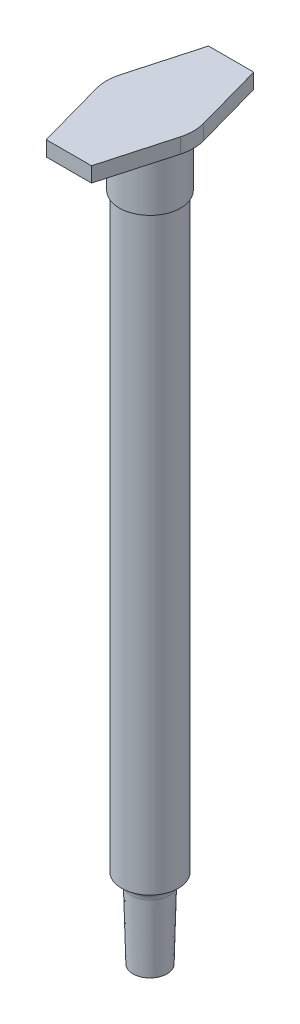
ISO-10303-21;
HEADER;
FILE_DESCRIPTION(('STEP AP214'),'2;1');
FILE_NAME('part.step','',(''),(''),'','','');
FILE_SCHEMA(('AUTOMOTIVE_DESIGN { 1 0 10303 214 1 1 1 1 }'));
ENDSEC;
DATA;
#1=APPLICATION_CONTEXT('core data for automotive mechanical design processes');
#2=APPLICATION_PROTOCOL_DEFINITION('international standard','automotive_design',2000,#1);
#3=PRODUCT_CONTEXT('',#1,'mechanical');
#4=PRODUCT('Part','Part','',(#3));
#5=PRODUCT_RELATED_PRODUCT_CATEGORY('part','',(#4));
#6=PRODUCT_DEFINITION_FORMATION('','',#4);
#7=PRODUCT_DEFINITION_CONTEXT('part definition',#1,'design');
#8=PRODUCT_DEFINITION('design','',#6,#7);
#9=PRODUCT_DEFINITION_SHAPE('','',#8);
#10=(LENGTH_UNIT() NAMED_UNIT(*) SI_UNIT(.MILLI.,.METRE.));
#11=(NAMED_UNIT(*) PLANE_ANGLE_UNIT() SI_UNIT($,.RADIAN.));
#12=(NAMED_UNIT(*) SI_UNIT($,.STERADIAN.) SOLID_ANGLE_UNIT());
#13=UNCERTAINTY_MEASURE_WITH_UNIT(LENGTH_MEASURE(1.E-05),#10,'distance_accuracy_value','');
#14=(GEOMETRIC_REPRESENTATION_CONTEXT(3) GLOBAL_UNCERTAINTY_ASSIGNED_CONTEXT((#13)) GLOBAL_UNIT_ASSIGNED_CONTEXT((#10,
#11,#12)) REPRESENTATION_CONTEXT('',''));
#15=CARTESIAN_POINT('',(0.,0.,0.));
#16=DIRECTION('',(0.,0.,1.));
#17=DIRECTION('',(1.,0.,0.));
#18=AXIS2_PLACEMENT_3D('',#15,#16,#17);
#19=CARTESIAN_POINT('',(0.,69.2,0.));
#20=DIRECTION('',(0.,-1.,0.));
#21=DIRECTION('',(0.,0.,-1.));
#22=AXIS2_PLACEMENT_3D('',#19,#20,#21);
#23=CYLINDRICAL_SURFACE('',#22,3.325);
#24=CARTESIAN_POINT('',(0.,69.2,0.));
#25=DIRECTION('',(0.,1.,0.));
#26=DIRECTION('',(0.,0.,1.));
#27=AXIS2_PLACEMENT_3D('',#24,#25,#26);
#28=CIRCLE('',#27,3.325);
#29=CARTESIAN_POINT('',(0.,69.2,3.325));
#30=VERTEX_POINT('',#29);
#31=EDGE_CURVE('E11',#30,#30,#28,.T.);
#32=ORIENTED_EDGE('',*,*,#31,.F.);
#33=EDGE_LOOP('',(#32));
#34=FACE_BOUND('',#33,.T.);
#35=CARTESIAN_POINT('',(0.,0.,0.));
#36=DIRECTION('',(0.,1.,0.));
#37=DIRECTION('',(0.,0.,1.));
#38=AXIS2_PLACEMENT_3D('',#35,#36,#37);
#39=CIRCLE('',#38,3.325);
#40=CARTESIAN_POINT('',(0.,0.,3.325));
#41=VERTEX_POINT('',#40);
#42=EDGE_CURVE('E164',#41,#41,#39,.T.);
#43=ORIENTED_EDGE('',*,*,#42,.T.);
#44=EDGE_LOOP('',(#43));
#45=FACE_BOUND('',#44,.T.);
#46=ADVANCED_FACE('F40',(#34,#45),#23,.T.);
#47=CARTESIAN_POINT('',(0.,69.2,0.));
#48=DIRECTION('',(0.,1.,0.));
#49=DIRECTION('',(0.,0.,1.));
#50=AXIS2_PLACEMENT_3D('',#47,#48,#49);
#51=PLANE('',#50);
#52=CARTESIAN_POINT('',(0.,69.2,0.));
#53=DIRECTION('',(0.,1.,0.));
#54=DIRECTION('',(0.,0.,1.));
#55=AXIS2_PLACEMENT_3D('',#52,#53,#54);
#56=CIRCLE('',#55,3.59);
#57=CARTESIAN_POINT('',(0.,69.2,3.59));
#58=VERTEX_POINT('',#57);
#59=EDGE_CURVE('E203',#58,#58,#56,.T.);
#60=ORIENTED_EDGE('',*,*,#59,.F.);
#61=EDGE_LOOP('',(#60));
#62=FACE_BOUND('',#61,.T.);
#63=ORIENTED_EDGE('',*,*,#31,.T.);
#64=EDGE_LOOP('',(#63));
#65=FACE_BOUND('',#64,.T.);
#66=ADVANCED_FACE('F213',(#62,#65),#51,.F.);
#67=CARTESIAN_POINT('',(0.,76.02,0.));
#68=DIRECTION('',(0.,-1.,0.));
#69=DIRECTION('',(0.,0.,-1.));
#70=AXIS2_PLACEMENT_3D('',#67,#68,#69);
#71=CYLINDRICAL_SURFACE('',#70,3.59);
#72=CARTESIAN_POINT('',(0.,76.02,0.));
#73=DIRECTION('',(0.,1.,0.));
#74=DIRECTION('',(0.,0.,1.));
#75=AXIS2_PLACEMENT_3D('',#72,#73,#74);
#76=CIRCLE('',#75,3.59);
#77=CARTESIAN_POINT('',(0.,76.02,3.59));
#78=VERTEX_POINT('',#77);
#79=EDGE_CURVE('E49',#78,#78,#76,.T.);
#80=ORIENTED_EDGE('',*,*,#79,.F.);
#81=EDGE_LOOP('',(#80));
#82=FACE_BOUND('',#81,.T.);
#83=ORIENTED_EDGE('',*,*,#59,.T.);
#84=EDGE_LOOP('',(#83));
#85=FACE_BOUND('',#84,.T.);
#86=ADVANCED_FACE('F211',(#82,#85),#71,.T.);
#87=CARTESIAN_POINT('',(0.,76.02,0.));
#88=DIRECTION('',(0.,1.,0.));
#89=DIRECTION('',(0.,0.,1.));
#90=AXIS2_PLACEMENT_3D('',#87,#88,#89);
#91=PLANE('',#90);
#92=CARTESIAN_POINT('',(0.,76.02,0.));
#93=DIRECTION('',(0.,1.,0.));
#94=DIRECTION('',(0.,0.,1.));
#95=AXIS2_PLACEMENT_3D('',#92,#93,#94);
#96=CIRCLE('',#95,5.10500000000001);
#97=CARTESIAN_POINT('',(-4.91772543004469,76.02,-1.37003707785296));
#98=VERTEX_POINT('',#97);
#99=CARTESIAN_POINT('',(-4.91772543004469,76.02,1.37003707785296));
#100=VERTEX_POINT('',#99);
#101=EDGE_CURVE('E159',#98,#100,#96,.T.);
#102=ORIENTED_EDGE('',*,*,#101,.F.);
#103=DIRECTION('',(-0.26837161172438,0.,0.963315461321191));
#104=VECTOR('',#103,1.);
#105=CARTESIAN_POINT('',(-4.91772543004469,76.02,-1.37003707785296));
#106=LINE('',#105,#104);
#107=CARTESIAN_POINT('',(-2.65,76.02,-9.51));
#108=VERTEX_POINT('',#107);
#109=EDGE_CURVE('E102',#108,#98,#106,.T.);
#110=ORIENTED_EDGE('',*,*,#109,.F.);
#111=DIRECTION('',(-1.,0.,0.));
#112=VECTOR('',#111,1.);
#113=CARTESIAN_POINT('',(-2.65,76.02,-9.51));
#114=LINE('',#113,#112);
#115=CARTESIAN_POINT('',(2.65,76.02,-9.51));
#116=VERTEX_POINT('',#115);
#117=EDGE_CURVE('E96',#116,#108,#114,.T.);
#118=ORIENTED_EDGE('',*,*,#117,.F.);
#119=DIRECTION('',(-0.26837161172438,0.,-0.963315461321191));
#120=VECTOR('',#119,1.);
#121=CARTESIAN_POINT('',(2.65,76.02,-9.51));
#122=LINE('',#121,#120);
#123=CARTESIAN_POINT('',(4.91772543004469,76.02,-1.37003707785296));
#124=VERTEX_POINT('',#123);
#125=EDGE_CURVE('E145',#124,#116,#122,.T.);
#126=ORIENTED_EDGE('',*,*,#125,.F.);
#127=CARTESIAN_POINT('',(0.,76.02,0.));
#128=DIRECTION('',(0.,1.,0.));
#129=DIRECTION('',(0.,0.,1.));
#130=AXIS2_PLACEMENT_3D('',#127,#128,#129);
#131=CIRCLE('',#130,5.10500000000001);
#132=CARTESIAN_POINT('',(4.91772543004469,76.02,1.37003707785296));
#133=VERTEX_POINT('',#132);
#134=EDGE_CURVE('E173',#133,#124,#131,.T.);
#135=ORIENTED_EDGE('',*,*,#134,.F.);
#136=DIRECTION('',(0.26837161172438,0.,-0.963315461321191));
#137=VECTOR('',#136,1.);
#138=CARTESIAN_POINT('',(2.65,76.02,9.51));
#139=LINE('',#138,#137);
#140=CARTESIAN_POINT('',(2.65,76.02,9.51));
#141=VERTEX_POINT('',#140);
#142=EDGE_CURVE('E170',#141,#133,#139,.T.);
#143=ORIENTED_EDGE('',*,*,#142,.F.);
#144=DIRECTION('',(1.,0.,0.));
#145=VECTOR('',#144,1.);
#146=CARTESIAN_POINT('',(-2.65,76.02,9.51));
#147=LINE('',#146,#145);
#148=CARTESIAN_POINT('',(-2.65,76.02,9.51));
#149=VERTEX_POINT('',#148);
#150=EDGE_CURVE('E167',#149,#141,#147,.T.);
#151=ORIENTED_EDGE('',*,*,#150,.F.);
#152=DIRECTION('',(0.26837161172438,0.,0.963315461321191));
#153=VECTOR('',#152,1.);
#154=CARTESIAN_POINT('',(-4.91772543004469,76.02,1.37003707785296));
#155=LINE('',#154,#153);
#156=EDGE_CURVE('E163',#100,#149,#155,.T.);
#157=ORIENTED_EDGE('',*,*,#156,.F.);
#158=EDGE_LOOP('',(#102,#110,#118,#126,#135,#143,#151,#157));
#159=FACE_BOUND('',#158,.T.);
#160=ORIENTED_EDGE('',*,*,#79,.T.);
#161=EDGE_LOOP('',(#160));
#162=FACE_BOUND('',#161,.T.);
#163=ADVANCED_FACE('F254',(#159,#162),#91,.F.);
#164=CARTESIAN_POINT('',(0.,77.78,0.));
#165=DIRECTION('',(0.,-1.,0.));
#166=DIRECTION('',(0.,0.,-1.));
#167=AXIS2_PLACEMENT_3D('',#164,#165,#166);
#168=CYLINDRICAL_SURFACE('',#167,5.10500000000001);
#169=ORIENTED_EDGE('',*,*,#101,.T.);
#170=DIRECTION('',(0.,-1.,0.));
#171=VECTOR('',#170,1.);
#172=CARTESIAN_POINT('',(-4.91772543004469,77.78,1.37003707785296));
#173=LINE('',#172,#171);
#174=CARTESIAN_POINT('',(-4.91772543004469,77.78,1.37003707785296));
#175=VERTEX_POINT('',#174);
#176=EDGE_CURVE('E200',#175,#100,#173,.T.);
#177=ORIENTED_EDGE('',*,*,#176,.F.);
#178=CARTESIAN_POINT('',(0.,77.78,0.));
#179=DIRECTION('',(0.,1.,0.));
#180=DIRECTION('',(0.,0.,1.));
#181=AXIS2_PLACEMENT_3D('',#178,#179,#180);
#182=CIRCLE('',#181,5.10500000000001);
#183=CARTESIAN_POINT('',(-4.91772543004469,77.78,-1.37003707785296));
#184=VERTEX_POINT('',#183);
#185=EDGE_CURVE('E181',#184,#175,#182,.T.);
#186=ORIENTED_EDGE('',*,*,#185,.F.);
#187=DIRECTION('',(0.,-1.,0.));
#188=VECTOR('',#187,1.);
#189=CARTESIAN_POINT('',(-4.91772543004469,77.78,-1.37003707785296));
#190=LINE('',#189,#188);
#191=EDGE_CURVE('E155',#184,#98,#190,.T.);
#192=ORIENTED_EDGE('',*,*,#191,.T.);
#193=EDGE_LOOP('',(#169,#177,#186,#192));
#194=FACE_BOUND('',#193,.T.);
#195=ADVANCED_FACE('F259',(#194),#168,.T.);
#196=CARTESIAN_POINT('',(-4.91772543004469,77.78,1.37003707785296));
#197=DIRECTION('',(0.963315461321191,0.,-0.26837161172438));
#198=DIRECTION('',(-0.26837161172438,0.,-0.963315461321191));
#199=AXIS2_PLACEMENT_3D('',#196,#197,#198);
#200=PLANE('',#199);
#201=ORIENTED_EDGE('',*,*,#156,.T.);
#202=DIRECTION('',(0.,-1.,0.));
#203=VECTOR('',#202,1.);
#204=CARTESIAN_POINT('',(-2.65,77.78,9.51));
#205=LINE('',#204,#203);
#206=CARTESIAN_POINT('',(-2.65,77.78,9.51));
#207=VERTEX_POINT('',#206);
#208=EDGE_CURVE('E196',#207,#149,#205,.T.);
#209=ORIENTED_EDGE('',*,*,#208,.F.);
#210=DIRECTION('',(0.26837161172438,0.,0.963315461321191));
#211=VECTOR('',#210,1.);
#212=CARTESIAN_POINT('',(-4.91772543004469,77.78,1.37003707785296));
#213=LINE('',#212,#211);
#214=EDGE_CURVE('E112',#175,#207,#213,.T.);
#215=ORIENTED_EDGE('',*,*,#214,.F.);
#216=ORIENTED_EDGE('',*,*,#176,.T.);
#217=EDGE_LOOP('',(#201,#209,#215,#216));
#218=FACE_BOUND('',#217,.T.);
#219=ADVANCED_FACE('F282',(#218),#200,.F.);
#220=CARTESIAN_POINT('',(-2.65,77.78,9.51));
#221=DIRECTION('',(0.,0.,-1.));
#222=DIRECTION('',(-1.,0.,0.));
#223=AXIS2_PLACEMENT_3D('',#220,#221,#222);
#224=PLANE('',#223);
#225=ORIENTED_EDGE('',*,*,#150,.T.);
#226=DIRECTION('',(0.,-1.,0.));
#227=VECTOR('',#226,1.);
#228=CARTESIAN_POINT('',(2.65,77.78,9.51));
#229=LINE('',#228,#227);
#230=CARTESIAN_POINT('',(2.65,77.78,9.51));
#231=VERTEX_POINT('',#230);
#232=EDGE_CURVE('E192',#231,#141,#229,.T.);
#233=ORIENTED_EDGE('',*,*,#232,.F.);
#234=DIRECTION('',(1.,0.,0.));
#235=VECTOR('',#234,1.);
#236=CARTESIAN_POINT('',(-2.65,77.78,9.51));
#237=LINE('',#236,#235);
#238=EDGE_CURVE('E236',#207,#231,#237,.T.);
#239=ORIENTED_EDGE('',*,*,#238,.F.);
#240=ORIENTED_EDGE('',*,*,#208,.T.);
#241=EDGE_LOOP('',(#225,#233,#239,#240));
#242=FACE_BOUND('',#241,.T.);
#243=ADVANCED_FACE('F279',(#242),#224,.F.);
#244=CARTESIAN_POINT('',(2.65,77.78,9.51));
#245=DIRECTION('',(-0.963315461321191,0.,-0.26837161172438));
#246=DIRECTION('',(-0.26837161172438,0.,0.963315461321191));
#247=AXIS2_PLACEMENT_3D('',#244,#245,#246);
#248=PLANE('',#247);
#249=ORIENTED_EDGE('',*,*,#142,.T.);
#250=DIRECTION('',(0.,-1.,0.));
#251=VECTOR('',#250,1.);
#252=CARTESIAN_POINT('',(4.91772543004469,77.78,1.37003707785296));
#253=LINE('',#252,#251);
#254=CARTESIAN_POINT('',(4.91772543004469,77.78,1.37003707785296));
#255=VERTEX_POINT('',#254);
#256=EDGE_CURVE('E188',#255,#133,#253,.T.);
#257=ORIENTED_EDGE('',*,*,#256,.F.);
#258=DIRECTION('',(0.26837161172438,0.,-0.963315461321191));
#259=VECTOR('',#258,1.);
#260=CARTESIAN_POINT('',(2.65,77.78,9.51));
#261=LINE('',#260,#259);
#262=EDGE_CURVE('E239',#231,#255,#261,.T.);
#263=ORIENTED_EDGE('',*,*,#262,.F.);
#264=ORIENTED_EDGE('',*,*,#232,.T.);
#265=EDGE_LOOP('',(#249,#257,#263,#264));
#266=FACE_BOUND('',#265,.T.);
#267=ADVANCED_FACE('F247',(#266),#248,.F.);
#268=CARTESIAN_POINT('',(0.,77.78,0.));
#269=DIRECTION('',(0.,-1.,0.));
#270=DIRECTION('',(0.,0.,-1.));
#271=AXIS2_PLACEMENT_3D('',#268,#269,#270);
#272=CYLINDRICAL_SURFACE('',#271,5.10500000000001);
#273=ORIENTED_EDGE('',*,*,#134,.T.);
#274=DIRECTION('',(0.,-1.,0.));
#275=VECTOR('',#274,1.);
#276=CARTESIAN_POINT('',(4.91772543004469,77.78,-1.37003707785296));
#277=LINE('',#276,#275);
#278=CARTESIAN_POINT('',(4.91772543004469,77.78,-1.37003707785296));
#279=VERTEX_POINT('',#278);
#280=EDGE_CURVE('E147',#279,#124,#277,.T.);
#281=ORIENTED_EDGE('',*,*,#280,.F.);
#282=CARTESIAN_POINT('',(0.,77.78,0.));
#283=DIRECTION('',(0.,1.,0.));
#284=DIRECTION('',(0.,0.,1.));
#285=AXIS2_PLACEMENT_3D('',#282,#283,#284);
#286=CIRCLE('',#285,5.10500000000001);
#287=EDGE_CURVE('E136',#255,#279,#286,.T.);
#288=ORIENTED_EDGE('',*,*,#287,.F.);
#289=ORIENTED_EDGE('',*,*,#256,.T.);
#290=EDGE_LOOP('',(#273,#281,#288,#289));
#291=FACE_BOUND('',#290,.T.);
#292=ADVANCED_FACE('F251',(#291),#272,.T.);
#293=CARTESIAN_POINT('',(2.65,77.78,-9.51));
#294=DIRECTION('',(-0.963315461321191,0.,0.26837161172438));
#295=DIRECTION('',(0.26837161172438,0.,0.963315461321191));
#296=AXIS2_PLACEMENT_3D('',#293,#294,#295);
#297=PLANE('',#296);
#298=ORIENTED_EDGE('',*,*,#125,.T.);
#299=DIRECTION('',(0.,-1.,0.));
#300=VECTOR('',#299,1.);
#301=CARTESIAN_POINT('',(2.65,77.78,-9.51));
#302=LINE('',#301,#300);
#303=CARTESIAN_POINT('',(2.65,77.78,-9.51));
#304=VERTEX_POINT('',#303);
#305=EDGE_CURVE('E142',#304,#116,#302,.T.);
#306=ORIENTED_EDGE('',*,*,#305,.F.);
#307=DIRECTION('',(-0.26837161172438,0.,-0.963315461321191));
#308=VECTOR('',#307,1.);
#309=CARTESIAN_POINT('',(2.65,77.78,-9.51));
#310=LINE('',#309,#308);
#311=EDGE_CURVE('E130',#279,#304,#310,.T.);
#312=ORIENTED_EDGE('',*,*,#311,.F.);
#313=ORIENTED_EDGE('',*,*,#280,.T.);
#314=EDGE_LOOP('',(#298,#306,#312,#313));
#315=FACE_BOUND('',#314,.T.);
#316=ADVANCED_FACE('F143',(#315),#297,.F.);
#317=CARTESIAN_POINT('',(-2.65,77.78,-9.51));
#318=DIRECTION('',(0.,0.,1.));
#319=DIRECTION('',(1.,0.,0.));
#320=AXIS2_PLACEMENT_3D('',#317,#318,#319);
#321=PLANE('',#320);
#322=ORIENTED_EDGE('',*,*,#117,.T.);
#323=DIRECTION('',(0.,-1.,0.));
#324=VECTOR('',#323,1.);
#325=CARTESIAN_POINT('',(-2.65,77.78,-9.51));
#326=LINE('',#325,#324);
#327=CARTESIAN_POINT('',(-2.65,77.78,-9.51));
#328=VERTEX_POINT('',#327);
#329=EDGE_CURVE('E148',#328,#108,#326,.T.);
#330=ORIENTED_EDGE('',*,*,#329,.F.);
#331=DIRECTION('',(-1.,0.,0.));
#332=VECTOR('',#331,1.);
#333=CARTESIAN_POINT('',(-2.65,77.78,-9.51));
#334=LINE('',#333,#332);
#335=EDGE_CURVE('E134',#304,#328,#334,.T.);
#336=ORIENTED_EDGE('',*,*,#335,.F.);
#337=ORIENTED_EDGE('',*,*,#305,.T.);
#338=EDGE_LOOP('',(#322,#330,#336,#337));
#339=FACE_BOUND('',#338,.T.);
#340=ADVANCED_FACE('F150',(#339),#321,.F.);
#341=CARTESIAN_POINT('',(-4.91772543004469,77.78,-1.37003707785296));
#342=DIRECTION('',(0.963315461321191,0.,0.26837161172438));
#343=DIRECTION('',(0.26837161172438,0.,-0.963315461321191));
#344=AXIS2_PLACEMENT_3D('',#341,#342,#343);
#345=PLANE('',#344);
#346=ORIENTED_EDGE('',*,*,#109,.T.);
#347=ORIENTED_EDGE('',*,*,#191,.F.);
#348=DIRECTION('',(-0.26837161172438,0.,0.963315461321191));
#349=VECTOR('',#348,1.);
#350=CARTESIAN_POINT('',(-4.91772543004469,77.78,-1.37003707785296));
#351=LINE('',#350,#349);
#352=EDGE_CURVE('E60',#328,#184,#351,.T.);
#353=ORIENTED_EDGE('',*,*,#352,.F.);
#354=ORIENTED_EDGE('',*,*,#329,.T.);
#355=EDGE_LOOP('',(#346,#347,#353,#354));
#356=FACE_BOUND('',#355,.T.);
#357=ADVANCED_FACE('F261',(#356),#345,.F.);
#358=CARTESIAN_POINT('',(0.,77.78,0.));
#359=DIRECTION('',(0.,1.,0.));
#360=DIRECTION('',(0.,0.,1.));
#361=AXIS2_PLACEMENT_3D('',#358,#359,#360);
#362=PLANE('',#361);
#363=ORIENTED_EDGE('',*,*,#185,.T.);
#364=ORIENTED_EDGE('',*,*,#214,.T.);
#365=ORIENTED_EDGE('',*,*,#238,.T.);
#366=ORIENTED_EDGE('',*,*,#262,.T.);
#367=ORIENTED_EDGE('',*,*,#287,.T.);
#368=ORIENTED_EDGE('',*,*,#311,.T.);
#369=ORIENTED_EDGE('',*,*,#335,.T.);
#370=ORIENTED_EDGE('',*,*,#352,.T.);
#371=EDGE_LOOP('',(#363,#364,#365,#366,#367,#368,#369,#370));
#372=FACE_BOUND('',#371,.T.);
#373=ADVANCED_FACE('F132',(#372),#362,.T.);
#374=CARTESIAN_POINT('',(0.,-1.33538980494671,0.));
#375=DIRECTION('',(0.,1.,0.));
#376=DIRECTION('',(0.,0.,1.));
#377=AXIS2_PLACEMENT_3D('',#374,#375,#376);
#378=TOROIDAL_SURFACE('',#377,3.56660918962397,1.35707071726803);
#379=ORIENTED_EDGE('',*,*,#42,.F.);
#380=EDGE_LOOP('',(#379));
#381=FACE_BOUND('',#380,.T.);
#382=CARTESIAN_POINT('',(0.,-1.3,0.));
#383=DIRECTION('',(0.,1.,0.));
#384=DIRECTION('',(0.,0.,1.));
#385=AXIS2_PLACEMENT_3D('',#382,#383,#384);
#386=CIRCLE('',#385,2.21);
#387=CARTESIAN_POINT('',(0.,-1.3,2.21));
#388=VERTEX_POINT('',#387);
#389=EDGE_CURVE('E225',#388,#388,#386,.T.);
#390=ORIENTED_EDGE('',*,*,#389,.T.);
#391=EDGE_LOOP('',(#390));
#392=FACE_BOUND('',#391,.T.);
#393=ADVANCED_FACE('F268',(#381,#392),#378,.F.);
#394=CARTESIAN_POINT('',(0.,-9.35,0.));
#395=DIRECTION('',(0.,1.,0.));
#396=DIRECTION('',(0.,0.,1.));
#397=AXIS2_PLACEMENT_3D('',#394,#395,#396);
#398=CONICAL_SURFACE('',#397,2.,0.0260810412907523);
#399=ORIENTED_EDGE('',*,*,#389,.F.);
#400=EDGE_LOOP('',(#399));
#401=FACE_BOUND('',#400,.T.);
#402=CARTESIAN_POINT('',(0.,-9.35,0.));
#403=DIRECTION('',(0.,1.,0.));
#404=DIRECTION('',(0.,0.,1.));
#405=AXIS2_PLACEMENT_3D('',#402,#403,#404);
#406=CIRCLE('',#405,2.);
#407=CARTESIAN_POINT('',(0.,-9.35,2.));
#408=VERTEX_POINT('',#407);
#409=EDGE_CURVE('E229',#408,#408,#406,.T.);
#410=ORIENTED_EDGE('',*,*,#409,.T.);
#411=EDGE_LOOP('',(#410));
#412=FACE_BOUND('',#411,.T.);
#413=ADVANCED_FACE('F343',(#401,#412),#398,.T.);
#414=CARTESIAN_POINT('',(0.,-9.35,0.));
#415=DIRECTION('',(0.,1.,0.));
#416=DIRECTION('',(0.,0.,1.));
#417=AXIS2_PLACEMENT_3D('',#414,#415,#416);
#418=PLANE('',#417);
#419=ORIENTED_EDGE('',*,*,#409,.F.);
#420=EDGE_LOOP('',(#419));
#421=FACE_BOUND('',#420,.T.);
#422=ADVANCED_FACE('F353',(#421),#418,.F.);
#423=CLOSED_SHELL('',(#46,#66,#86,#163,#195,#219,#243,#267,#292,#316,#340,#357,#373,#393,#413,#422));
#424=MANIFOLD_SOLID_BREP('B2',#423);
#425=ADVANCED_BREP_SHAPE_REPRESENTATION('',(#18,#424),#14);
#426=SHAPE_DEFINITION_REPRESENTATION(#9,#425);
ENDSEC;
END-ISO-10303-21;
